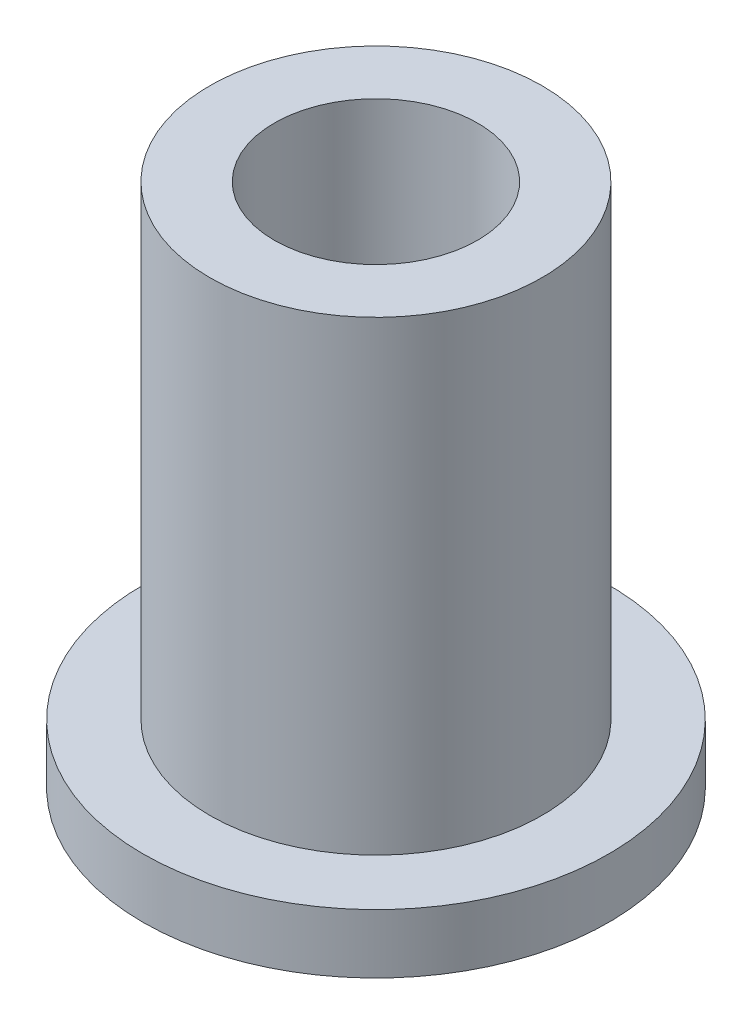
ISO-10303-21;
HEADER;
FILE_DESCRIPTION(('STEP AP214'),'2;1');
FILE_NAME('part.step','',(''),(''),'','','');
FILE_SCHEMA(('AUTOMOTIVE_DESIGN { 1 0 10303 214 1 1 1 1 }'));
ENDSEC;
DATA;
#1=APPLICATION_CONTEXT('core data for automotive mechanical design processes');
#2=APPLICATION_PROTOCOL_DEFINITION('international standard','automotive_design',2000,#1);
#3=PRODUCT_CONTEXT('',#1,'mechanical');
#4=PRODUCT('Part','Part','',(#3));
#5=PRODUCT_RELATED_PRODUCT_CATEGORY('part','',(#4));
#6=PRODUCT_DEFINITION_FORMATION('','',#4);
#7=PRODUCT_DEFINITION_CONTEXT('part definition',#1,'design');
#8=PRODUCT_DEFINITION('design','',#6,#7);
#9=PRODUCT_DEFINITION_SHAPE('','',#8);
#10=(LENGTH_UNIT() NAMED_UNIT(*) SI_UNIT(.MILLI.,.METRE.));
#11=(NAMED_UNIT(*) PLANE_ANGLE_UNIT() SI_UNIT($,.RADIAN.));
#12=(NAMED_UNIT(*) SI_UNIT($,.STERADIAN.) SOLID_ANGLE_UNIT());
#13=UNCERTAINTY_MEASURE_WITH_UNIT(LENGTH_MEASURE(1.E-05),#10,'distance_accuracy_value','');
#14=(GEOMETRIC_REPRESENTATION_CONTEXT(3) GLOBAL_UNCERTAINTY_ASSIGNED_CONTEXT((#13)) GLOBAL_UNIT_ASSIGNED_CONTEXT((#10,
#11,#12)) REPRESENTATION_CONTEXT('',''));
#15=CARTESIAN_POINT('',(0.,0.,0.));
#16=DIRECTION('',(0.,0.,1.));
#17=DIRECTION('',(1.,0.,0.));
#18=AXIS2_PLACEMENT_3D('',#15,#16,#17);
#19=CARTESIAN_POINT('',(0.,0.,0.));
#20=DIRECTION('',(0.,1.,0.));
#21=DIRECTION('',(0.,0.,1.));
#22=AXIS2_PLACEMENT_3D('',#19,#20,#21);
#23=CYLINDRICAL_SURFACE('',#22,5.5);
#24=CARTESIAN_POINT('',(0.,0.,0.));
#25=DIRECTION('',(0.,1.,0.));
#26=DIRECTION('',(0.,0.,1.));
#27=AXIS2_PLACEMENT_3D('',#24,#25,#26);
#28=CIRCLE('',#27,5.5);
#29=CARTESIAN_POINT('',(0.,0.,5.5));
#30=VERTEX_POINT('',#29);
#31=EDGE_CURVE('E10',#30,#30,#28,.T.);
#32=ORIENTED_EDGE('',*,*,#31,.T.);
#33=EDGE_LOOP('',(#32));
#34=FACE_BOUND('',#33,.T.);
#35=CARTESIAN_POINT('',(0.,1.4,0.));
#36=DIRECTION('',(0.,1.,0.));
#37=DIRECTION('',(0.,0.,1.));
#38=AXIS2_PLACEMENT_3D('',#35,#36,#37);
#39=CIRCLE('',#38,5.5);
#40=CARTESIAN_POINT('',(0.,1.4,5.5));
#41=VERTEX_POINT('',#40);
#42=EDGE_CURVE('E55',#41,#41,#39,.T.);
#43=ORIENTED_EDGE('',*,*,#42,.F.);
#44=EDGE_LOOP('',(#43));
#45=FACE_BOUND('',#44,.T.);
#46=ADVANCED_FACE('F30',(#34,#45),#23,.T.);
#47=CARTESIAN_POINT('',(5.5,0.,0.));
#48=DIRECTION('',(0.,-1.,0.));
#49=DIRECTION('',(0.,0.,-1.));
#50=AXIS2_PLACEMENT_3D('',#47,#48,#49);
#51=PLANE('',#50);
#52=CARTESIAN_POINT('',(0.,0.,0.));
#53=DIRECTION('',(0.,1.,0.));
#54=DIRECTION('',(0.,0.,1.));
#55=AXIS2_PLACEMENT_3D('',#52,#53,#54);
#56=CIRCLE('',#55,2.59999999991578);
#57=CARTESIAN_POINT('',(0.,0.,2.59999999991578));
#58=VERTEX_POINT('',#57);
#59=EDGE_CURVE('E36',#58,#58,#56,.T.);
#60=ORIENTED_EDGE('',*,*,#59,.T.);
#61=EDGE_LOOP('',(#60));
#62=FACE_BOUND('',#61,.T.);
#63=ORIENTED_EDGE('',*,*,#31,.F.);
#64=EDGE_LOOP('',(#63));
#65=FACE_BOUND('',#64,.T.);
#66=ADVANCED_FACE('F63',(#62,#65),#51,.T.);
#67=CARTESIAN_POINT('',(0.,0.,0.));
#68=DIRECTION('',(0.,-1.,0.));
#69=DIRECTION('',(0.,0.,-1.));
#70=AXIS2_PLACEMENT_3D('',#67,#68,#69);
#71=CONICAL_SURFACE('',#70,2.59999999991578,0.785398163397448);
#72=CARTESIAN_POINT('',(0.,0.199999999957891,0.));
#73=DIRECTION('',(0.,1.,0.));
#74=DIRECTION('',(0.,0.,1.));
#75=AXIS2_PLACEMENT_3D('',#72,#73,#74);
#76=CIRCLE('',#75,2.39999999995789);
#77=CARTESIAN_POINT('',(0.,0.199999999957891,2.39999999995789));
#78=VERTEX_POINT('',#77);
#79=EDGE_CURVE('E40',#78,#78,#76,.T.);
#80=ORIENTED_EDGE('',*,*,#79,.T.);
#81=EDGE_LOOP('',(#80));
#82=FACE_BOUND('',#81,.T.);
#83=ORIENTED_EDGE('',*,*,#59,.F.);
#84=EDGE_LOOP('',(#83));
#85=FACE_BOUND('',#84,.T.);
#86=ADVANCED_FACE('F67',(#82,#85),#71,.F.);
#87=CARTESIAN_POINT('',(0.,0.,0.));
#88=DIRECTION('',(0.,1.,0.));
#89=DIRECTION('',(0.,0.,1.));
#90=AXIS2_PLACEMENT_3D('',#87,#88,#89);
#91=CYLINDRICAL_SURFACE('',#90,2.39999999995789);
#92=CARTESIAN_POINT('',(0.,12.4,0.));
#93=DIRECTION('',(0.,1.,0.));
#94=DIRECTION('',(0.,0.,1.));
#95=AXIS2_PLACEMENT_3D('',#92,#93,#94);
#96=CIRCLE('',#95,2.39999999995789);
#97=CARTESIAN_POINT('',(0.,12.4,2.39999999995789));
#98=VERTEX_POINT('',#97);
#99=EDGE_CURVE('E44',#98,#98,#96,.T.);
#100=ORIENTED_EDGE('',*,*,#99,.T.);
#101=EDGE_LOOP('',(#100));
#102=FACE_BOUND('',#101,.T.);
#103=ORIENTED_EDGE('',*,*,#79,.F.);
#104=EDGE_LOOP('',(#103));
#105=FACE_BOUND('',#104,.T.);
#106=ADVANCED_FACE('F71',(#102,#105),#91,.F.);
#107=CARTESIAN_POINT('',(2.39999999995789,12.4,0.));
#108=DIRECTION('',(0.,1.,0.));
#109=DIRECTION('',(0.,0.,1.));
#110=AXIS2_PLACEMENT_3D('',#107,#108,#109);
#111=PLANE('',#110);
#112=CARTESIAN_POINT('',(0.,12.4,0.));
#113=DIRECTION('',(0.,1.,0.));
#114=DIRECTION('',(0.,0.,1.));
#115=AXIS2_PLACEMENT_3D('',#112,#113,#114);
#116=CIRCLE('',#115,3.925);
#117=CARTESIAN_POINT('',(0.,12.4,3.925));
#118=VERTEX_POINT('',#117);
#119=EDGE_CURVE('E49',#118,#118,#116,.T.);
#120=ORIENTED_EDGE('',*,*,#119,.T.);
#121=EDGE_LOOP('',(#120));
#122=FACE_BOUND('',#121,.T.);
#123=ORIENTED_EDGE('',*,*,#99,.F.);
#124=EDGE_LOOP('',(#123));
#125=FACE_BOUND('',#124,.T.);
#126=ADVANCED_FACE('F78',(#122,#125),#111,.T.);
#127=CARTESIAN_POINT('',(0.,0.,0.));
#128=DIRECTION('',(0.,1.,0.));
#129=DIRECTION('',(0.,0.,1.));
#130=AXIS2_PLACEMENT_3D('',#127,#128,#129);
#131=CYLINDRICAL_SURFACE('',#130,3.925);
#132=CARTESIAN_POINT('',(0.,1.4,0.));
#133=DIRECTION('',(0.,1.,0.));
#134=DIRECTION('',(0.,0.,1.));
#135=AXIS2_PLACEMENT_3D('',#132,#133,#134);
#136=CIRCLE('',#135,3.925);
#137=CARTESIAN_POINT('',(0.,1.4,3.925));
#138=VERTEX_POINT('',#137);
#139=EDGE_CURVE('E52',#138,#138,#136,.T.);
#140=ORIENTED_EDGE('',*,*,#139,.T.);
#141=EDGE_LOOP('',(#140));
#142=FACE_BOUND('',#141,.T.);
#143=ORIENTED_EDGE('',*,*,#119,.F.);
#144=EDGE_LOOP('',(#143));
#145=FACE_BOUND('',#144,.T.);
#146=ADVANCED_FACE('F82',(#142,#145),#131,.T.);
#147=CARTESIAN_POINT('',(3.925,1.4,0.));
#148=DIRECTION('',(0.,1.,0.));
#149=DIRECTION('',(0.,0.,1.));
#150=AXIS2_PLACEMENT_3D('',#147,#148,#149);
#151=PLANE('',#150);
#152=ORIENTED_EDGE('',*,*,#42,.T.);
#153=EDGE_LOOP('',(#152));
#154=FACE_BOUND('',#153,.T.);
#155=ORIENTED_EDGE('',*,*,#139,.F.);
#156=EDGE_LOOP('',(#155));
#157=FACE_BOUND('',#156,.T.);
#158=ADVANCED_FACE('F59',(#154,#157),#151,.T.);
#159=CLOSED_SHELL('',(#46,#66,#86,#106,#126,#146,#158));
#160=MANIFOLD_SOLID_BREP('B2',#159);
#161=ADVANCED_BREP_SHAPE_REPRESENTATION('',(#18,#160),#14);
#162=SHAPE_DEFINITION_REPRESENTATION(#9,#161);
ENDSEC;
END-ISO-10303-21;
